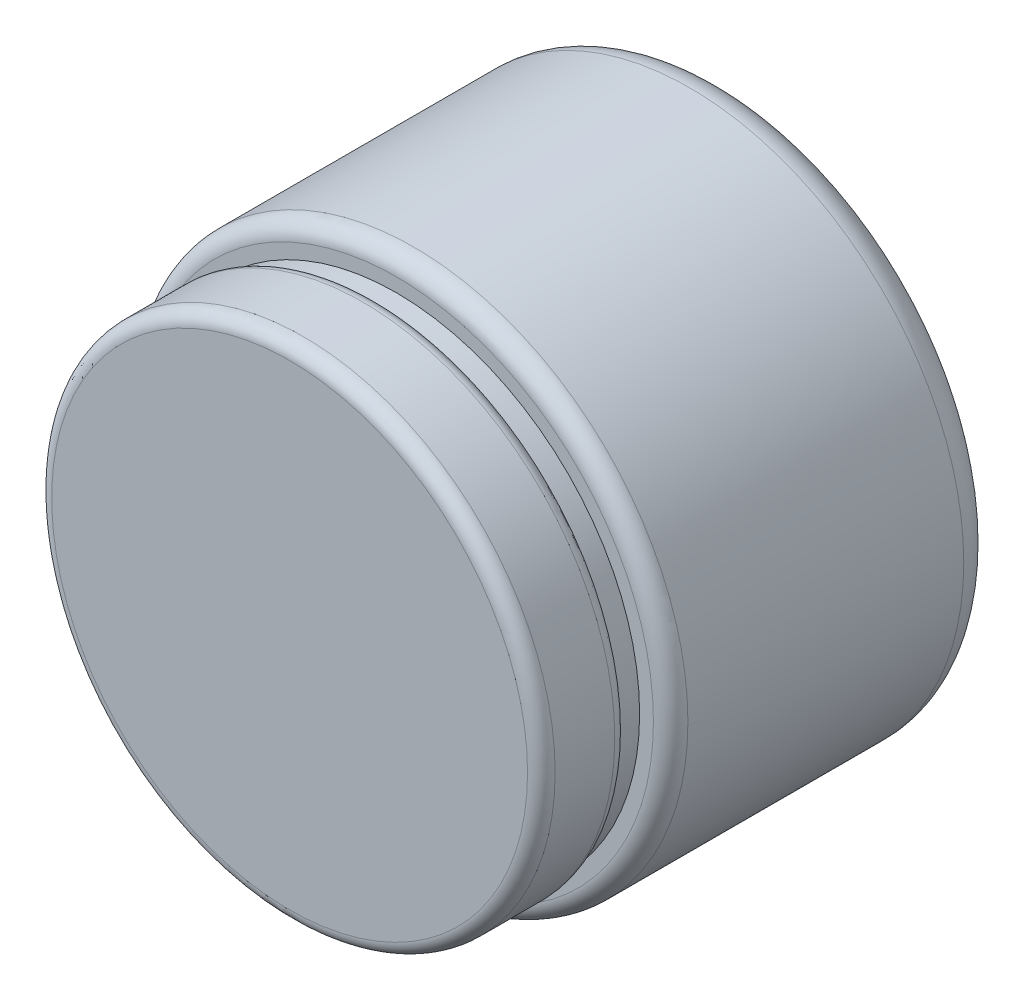
ISO-10303-21;
HEADER;
FILE_DESCRIPTION(('STEP AP214'),'2;1');
FILE_NAME('part.step','',(''),(''),'','','');
FILE_SCHEMA(('AUTOMOTIVE_DESIGN { 1 0 10303 214 1 1 1 1 }'));
ENDSEC;
DATA;
#1=APPLICATION_CONTEXT('core data for automotive mechanical design processes');
#2=APPLICATION_PROTOCOL_DEFINITION('international standard','automotive_design',2000,#1);
#3=PRODUCT_CONTEXT('',#1,'mechanical');
#4=PRODUCT('Part','Part','',(#3));
#5=PRODUCT_RELATED_PRODUCT_CATEGORY('part','',(#4));
#6=PRODUCT_DEFINITION_FORMATION('','',#4);
#7=PRODUCT_DEFINITION_CONTEXT('part definition',#1,'design');
#8=PRODUCT_DEFINITION('design','',#6,#7);
#9=PRODUCT_DEFINITION_SHAPE('','',#8);
#10=(LENGTH_UNIT() NAMED_UNIT(*) SI_UNIT(.MILLI.,.METRE.));
#11=(NAMED_UNIT(*) PLANE_ANGLE_UNIT() SI_UNIT($,.RADIAN.));
#12=(NAMED_UNIT(*) SI_UNIT($,.STERADIAN.) SOLID_ANGLE_UNIT());
#13=UNCERTAINTY_MEASURE_WITH_UNIT(LENGTH_MEASURE(1.E-05),#10,'distance_accuracy_value','');
#14=(GEOMETRIC_REPRESENTATION_CONTEXT(3) GLOBAL_UNCERTAINTY_ASSIGNED_CONTEXT((#13)) GLOBAL_UNIT_ASSIGNED_CONTEXT((#10,
#11,#12)) REPRESENTATION_CONTEXT('',''));
#15=CARTESIAN_POINT('',(0.,0.,0.));
#16=DIRECTION('',(0.,0.,1.));
#17=DIRECTION('',(1.,0.,0.));
#18=AXIS2_PLACEMENT_3D('',#15,#16,#17);
#19=CARTESIAN_POINT('',(0.,0.,12.7));
#20=DIRECTION('',(0.,0.,-1.));
#21=DIRECTION('',(-1.,0.,0.));
#22=AXIS2_PLACEMENT_3D('',#19,#20,#21);
#23=CYLINDRICAL_SURFACE('',#22,37.084);
#24=CARTESIAN_POINT('',(0.,0.,1.8837144157223));
#25=DIRECTION('',(0.,0.,-1.));
#26=DIRECTION('',(-1.,0.,0.));
#27=AXIS2_PLACEMENT_3D('',#24,#25,#26);
#28=CIRCLE('',#27,37.084);
#29=CARTESIAN_POINT('',(-37.084,0.,1.8837144157223));
#30=VERTEX_POINT('',#29);
#31=EDGE_CURVE('E40',#30,#30,#28,.F.);
#32=ORIENTED_EDGE('',*,*,#31,.T.);
#33=EDGE_LOOP('',(#32));
#34=FACE_BOUND('',#33,.T.);
#35=CARTESIAN_POINT('',(0.,0.,10.668));
#36=DIRECTION('',(0.,0.,1.));
#37=DIRECTION('',(1.,0.,0.));
#38=AXIS2_PLACEMENT_3D('',#35,#36,#37);
#39=CIRCLE('',#38,37.084);
#40=CARTESIAN_POINT('',(37.084,0.,10.668));
#41=VERTEX_POINT('',#40);
#42=EDGE_CURVE('E44',#41,#41,#39,.F.);
#43=ORIENTED_EDGE('',*,*,#42,.T.);
#44=EDGE_LOOP('',(#43));
#45=FACE_BOUND('',#44,.T.);
#46=ADVANCED_FACE('F33',(#34,#45),#23,.T.);
#47=CARTESIAN_POINT('',(0.,0.,12.7));
#48=DIRECTION('',(0.,0.,1.));
#49=DIRECTION('',(1.,0.,0.));
#50=AXIS2_PLACEMENT_3D('',#47,#48,#49);
#51=PLANE('',#50);
#52=CARTESIAN_POINT('',(0.,0.,12.7));
#53=DIRECTION('',(0.,0.,1.));
#54=DIRECTION('',(1.,0.,0.));
#55=AXIS2_PLACEMENT_3D('',#52,#53,#54);
#56=CIRCLE('',#55,35.052);
#57=CARTESIAN_POINT('',(35.052,0.,12.7));
#58=VERTEX_POINT('',#57);
#59=EDGE_CURVE('E10',#58,#58,#56,.T.);
#60=ORIENTED_EDGE('',*,*,#59,.T.);
#61=EDGE_LOOP('',(#60));
#62=FACE_BOUND('',#61,.T.);
#63=ADVANCED_FACE('F75',(#62),#51,.T.);
#64=CARTESIAN_POINT('',(0.,0.,-3.048));
#65=DIRECTION('',(0.,0.,1.));
#66=DIRECTION('',(1.,0.,0.));
#67=AXIS2_PLACEMENT_3D('',#64,#65,#66);
#68=CYLINDRICAL_SURFACE('',#67,35.814);
#69=CARTESIAN_POINT('',(0.,0.,-3.048));
#70=DIRECTION('',(0.,0.,-1.));
#71=DIRECTION('',(-1.,0.,0.));
#72=AXIS2_PLACEMENT_3D('',#69,#70,#71);
#73=CIRCLE('',#72,35.814);
#74=CARTESIAN_POINT('',(35.814,0.,-3.048));
#75=VERTEX_POINT('',#74);
#76=EDGE_CURVE('E65',#75,#75,#73,.T.);
#77=CARTESIAN_POINT('',(0.,0.,0.));
#78=DIRECTION('',(0.,0.,1.));
#79=DIRECTION('',(1.,0.,0.));
#80=AXIS2_PLACEMENT_3D('',#77,#78,#79);
#81=CIRCLE('',#80,35.814);
#82=CARTESIAN_POINT('',(35.814,0.,0.));
#83=VERTEX_POINT('',#82);
#84=EDGE_CURVE('E62',#83,#83,#81,.F.);
#85=CARTESIAN_POINT('',(35.814,0.,-3.048));
#86=CARTESIAN_POINT('',(35.814,0.,-3.01625));
#87=CARTESIAN_POINT('',(35.814,0.,-2.9845));
#88=CARTESIAN_POINT('',(35.814,0.,-2.921));
#89=CARTESIAN_POINT('',(35.814,0.,-2.88925));
#90=CARTESIAN_POINT('',(35.814,0.,-2.82575));
#91=CARTESIAN_POINT('',(35.814,0.,-2.794));
#92=CARTESIAN_POINT('',(35.814,0.,-2.7305));
#93=CARTESIAN_POINT('',(35.814,0.,-2.69875));
#94=CARTESIAN_POINT('',(35.814,0.,-2.63525));
#95=CARTESIAN_POINT('',(35.814,0.,-2.6035));
#96=CARTESIAN_POINT('',(35.814,0.,-2.54));
#97=CARTESIAN_POINT('',(35.814,0.,-2.50825));
#98=CARTESIAN_POINT('',(35.814,0.,-2.44475));
#99=CARTESIAN_POINT('',(35.814,0.,-2.413));
#100=CARTESIAN_POINT('',(35.814,0.,-2.3495));
#101=CARTESIAN_POINT('',(35.814,0.,-2.31775));
#102=CARTESIAN_POINT('',(35.814,0.,-2.25425));
#103=CARTESIAN_POINT('',(35.814,0.,-2.2225));
#104=CARTESIAN_POINT('',(35.814,0.,-2.159));
#105=CARTESIAN_POINT('',(35.814,0.,-2.12725));
#106=CARTESIAN_POINT('',(35.814,0.,-2.06375));
#107=CARTESIAN_POINT('',(35.814,0.,-2.032));
#108=CARTESIAN_POINT('',(35.814,0.,-1.9685));
#109=CARTESIAN_POINT('',(35.814,0.,-1.93675));
#110=CARTESIAN_POINT('',(35.814,0.,-1.87325));
#111=CARTESIAN_POINT('',(35.814,0.,-1.8415));
#112=CARTESIAN_POINT('',(35.814,0.,-1.778));
#113=CARTESIAN_POINT('',(35.814,0.,-1.74625));
#114=CARTESIAN_POINT('',(35.814,0.,-1.68275));
#115=CARTESIAN_POINT('',(35.814,0.,-1.651));
#116=CARTESIAN_POINT('',(35.814,0.,-1.5875));
#117=CARTESIAN_POINT('',(35.814,0.,-1.55575));
#118=CARTESIAN_POINT('',(35.814,0.,-1.49225));
#119=CARTESIAN_POINT('',(35.814,0.,-1.4605));
#120=CARTESIAN_POINT('',(35.814,0.,-1.397));
#121=CARTESIAN_POINT('',(35.814,0.,-1.36525));
#122=CARTESIAN_POINT('',(35.814,0.,-1.30175));
#123=CARTESIAN_POINT('',(35.814,0.,-1.27));
#124=CARTESIAN_POINT('',(35.814,0.,-1.2065));
#125=CARTESIAN_POINT('',(35.814,0.,-1.17475));
#126=CARTESIAN_POINT('',(35.814,0.,-1.11125));
#127=CARTESIAN_POINT('',(35.814,0.,-1.0795));
#128=CARTESIAN_POINT('',(35.814,0.,-1.016));
#129=CARTESIAN_POINT('',(35.814,0.,-0.98425));
#130=CARTESIAN_POINT('',(35.814,0.,-0.92075));
#131=CARTESIAN_POINT('',(35.814,0.,-0.889));
#132=CARTESIAN_POINT('',(35.814,0.,-0.8255));
#133=CARTESIAN_POINT('',(35.814,0.,-0.79375));
#134=CARTESIAN_POINT('',(35.814,0.,-0.73025));
#135=CARTESIAN_POINT('',(35.814,0.,-0.6985));
#136=CARTESIAN_POINT('',(35.814,0.,-0.635));
#137=CARTESIAN_POINT('',(35.814,0.,-0.60325));
#138=CARTESIAN_POINT('',(35.814,0.,-0.53975));
#139=CARTESIAN_POINT('',(35.814,0.,-0.508));
#140=CARTESIAN_POINT('',(35.814,0.,-0.4445));
#141=CARTESIAN_POINT('',(35.814,0.,-0.41275));
#142=CARTESIAN_POINT('',(35.814,0.,-0.34925));
#143=CARTESIAN_POINT('',(35.814,0.,-0.3175));
#144=CARTESIAN_POINT('',(35.814,0.,-0.254));
#145=CARTESIAN_POINT('',(35.814,0.,-0.22225));
#146=CARTESIAN_POINT('',(35.814,0.,-0.15875));
#147=CARTESIAN_POINT('',(35.814,0.,-0.127));
#148=CARTESIAN_POINT('',(35.814,0.,-0.0634999999999999));
#149=CARTESIAN_POINT('',(35.814,0.,-0.03175));
#150=CARTESIAN_POINT('',(35.814,0.,0.));
#151=B_SPLINE_CURVE_WITH_KNOTS('',3,(#85,#86,#87,#88,#89,#90,#91,#92,#93,#94,#95,#96,#97,#98,
#99,#100,#101,#102,#103,#104,#105,#106,#107,#108,#109,#110,#111,#112,#113,#114,#115,#116,#117,
#118,#119,#120,#121,#122,#123,#124,#125,#126,#127,#128,#129,#130,#131,#132,#133,#134,#135,#136,
#137,#138,#139,#140,#141,#142,#143,#144,#145,#146,#147,#148,#149,#150),.UNSPECIFIED.,.F.,.F.,(4,
2,2,2,2,2,2,2,2,2,2,2,2,2,2,2,2,2,2,2,2,2,2,2,2,2,2,2,2,2,2,2,4),(0.,0.0952499999999998,0.1905,
0.28575,0.381,0.47625,0.5715,0.66675,0.762,0.85725,0.9525,1.04775,1.143,1.23825,1.3335,1.42875,
1.524,1.61925,1.7145,1.80975,1.905,2.00025,2.0955,2.19075,2.286,2.38125,2.4765,2.57175,2.667,
2.76225,2.8575,2.95275,3.048),.UNSPECIFIED.);
#152=EDGE_CURVE('BSEAM71',#75,#83,#151,.T.);
#153=ORIENTED_EDGE('',*,*,#76,.F.);
#154=ORIENTED_EDGE('',*,*,#84,.T.);
#155=ORIENTED_EDGE('',*,*,#152,.T.);
#156=ORIENTED_EDGE('',*,*,#152,.F.);
#157=EDGE_LOOP('',(#153,#155,#154,#156));
#158=FACE_BOUND('',#157,.T.);
#159=ADVANCED_FACE('F71',(#158),#68,.T.);
#160=CARTESIAN_POINT('',(0.,0.,-51.308));
#161=DIRECTION('',(0.,0.,1.));
#162=DIRECTION('',(1.,0.,0.));
#163=AXIS2_PLACEMENT_3D('',#160,#161,#162);
#164=CYLINDRICAL_SURFACE('',#163,40.386);
#165=CARTESIAN_POINT('',(0.,0.,-46.228));
#166=DIRECTION('',(0.,0.,-1.));
#167=DIRECTION('',(-1.,0.,0.));
#168=AXIS2_PLACEMENT_3D('',#165,#166,#167);
#169=CIRCLE('',#168,40.386);
#170=CARTESIAN_POINT('',(40.386,0.,-46.228));
#171=VERTEX_POINT('',#170);
#172=EDGE_CURVE('E48',#171,#171,#169,.F.);
#173=CARTESIAN_POINT('',(0.,0.,-5.588));
#174=DIRECTION('',(0.,0.,-1.));
#175=DIRECTION('',(-1.,0.,0.));
#176=AXIS2_PLACEMENT_3D('',#173,#174,#175);
#177=CIRCLE('',#176,40.386);
#178=CARTESIAN_POINT('',(40.386,0.,-5.588));
#179=VERTEX_POINT('',#178);
#180=EDGE_CURVE('E59',#179,#179,#177,.T.);
#181=CARTESIAN_POINT('',(40.386,0.,-46.228));
#182=CARTESIAN_POINT('',(40.386,0.,-45.8046666666667));
#183=CARTESIAN_POINT('',(40.386,0.,-45.3813333333333));
#184=CARTESIAN_POINT('',(40.386,0.,-44.5346666666667));
#185=CARTESIAN_POINT('',(40.386,0.,-44.1113333333333));
#186=CARTESIAN_POINT('',(40.386,0.,-43.2646666666667));
#187=CARTESIAN_POINT('',(40.386,0.,-42.8413333333333));
#188=CARTESIAN_POINT('',(40.386,0.,-41.9946666666667));
#189=CARTESIAN_POINT('',(40.386,0.,-41.5713333333333));
#190=CARTESIAN_POINT('',(40.386,0.,-40.7246666666667));
#191=CARTESIAN_POINT('',(40.386,0.,-40.3013333333333));
#192=CARTESIAN_POINT('',(40.386,0.,-39.4546666666667));
#193=CARTESIAN_POINT('',(40.386,0.,-39.0313333333333));
#194=CARTESIAN_POINT('',(40.386,0.,-38.1846666666667));
#195=CARTESIAN_POINT('',(40.386,0.,-37.7613333333333));
#196=CARTESIAN_POINT('',(40.386,0.,-36.9146666666667));
#197=CARTESIAN_POINT('',(40.386,0.,-36.4913333333333));
#198=CARTESIAN_POINT('',(40.386,0.,-35.6446666666667));
#199=CARTESIAN_POINT('',(40.386,0.,-35.2213333333333));
#200=CARTESIAN_POINT('',(40.386,0.,-34.3746666666667));
#201=CARTESIAN_POINT('',(40.386,0.,-33.9513333333333));
#202=CARTESIAN_POINT('',(40.386,0.,-33.1046666666667));
#203=CARTESIAN_POINT('',(40.386,0.,-32.6813333333333));
#204=CARTESIAN_POINT('',(40.386,0.,-31.8346666666667));
#205=CARTESIAN_POINT('',(40.386,0.,-31.4113333333333));
#206=CARTESIAN_POINT('',(40.386,0.,-30.5646666666667));
#207=CARTESIAN_POINT('',(40.386,0.,-30.1413333333333));
#208=CARTESIAN_POINT('',(40.386,0.,-29.2946666666667));
#209=CARTESIAN_POINT('',(40.386,0.,-28.8713333333333));
#210=CARTESIAN_POINT('',(40.386,0.,-28.0246666666667));
#211=CARTESIAN_POINT('',(40.386,0.,-27.6013333333333));
#212=CARTESIAN_POINT('',(40.386,0.,-26.7546666666667));
#213=CARTESIAN_POINT('',(40.386,0.,-26.3313333333333));
#214=CARTESIAN_POINT('',(40.386,0.,-25.4846666666667));
#215=CARTESIAN_POINT('',(40.386,0.,-25.0613333333333));
#216=CARTESIAN_POINT('',(40.386,0.,-24.2146666666667));
#217=CARTESIAN_POINT('',(40.386,0.,-23.7913333333333));
#218=CARTESIAN_POINT('',(40.386,0.,-22.9446666666667));
#219=CARTESIAN_POINT('',(40.386,0.,-22.5213333333333));
#220=CARTESIAN_POINT('',(40.386,0.,-21.6746666666667));
#221=CARTESIAN_POINT('',(40.386,0.,-21.2513333333333));
#222=CARTESIAN_POINT('',(40.386,0.,-20.4046666666667));
#223=CARTESIAN_POINT('',(40.386,0.,-19.9813333333333));
#224=CARTESIAN_POINT('',(40.386,0.,-19.1346666666667));
#225=CARTESIAN_POINT('',(40.386,0.,-18.7113333333333));
#226=CARTESIAN_POINT('',(40.386,0.,-17.8646666666667));
#227=CARTESIAN_POINT('',(40.386,0.,-17.4413333333333));
#228=CARTESIAN_POINT('',(40.386,0.,-16.5946666666667));
#229=CARTESIAN_POINT('',(40.386,0.,-16.1713333333333));
#230=CARTESIAN_POINT('',(40.386,0.,-15.3246666666667));
#231=CARTESIAN_POINT('',(40.386,0.,-14.9013333333333));
#232=CARTESIAN_POINT('',(40.386,0.,-14.0546666666667));
#233=CARTESIAN_POINT('',(40.386,0.,-13.6313333333333));
#234=CARTESIAN_POINT('',(40.386,0.,-12.7846666666667));
#235=CARTESIAN_POINT('',(40.386,0.,-12.3613333333333));
#236=CARTESIAN_POINT('',(40.386,0.,-11.5146666666667));
#237=CARTESIAN_POINT('',(40.386,0.,-11.0913333333333));
#238=CARTESIAN_POINT('',(40.386,0.,-10.2446666666667));
#239=CARTESIAN_POINT('',(40.386,0.,-9.82133333333333));
#240=CARTESIAN_POINT('',(40.386,0.,-8.97466666666666));
#241=CARTESIAN_POINT('',(40.386,0.,-8.55133333333333));
#242=CARTESIAN_POINT('',(40.386,0.,-7.70466666666666));
#243=CARTESIAN_POINT('',(40.386,0.,-7.28133333333332));
#244=CARTESIAN_POINT('',(40.386,0.,-6.43466666666666));
#245=CARTESIAN_POINT('',(40.386,0.,-6.01133333333333));
#246=CARTESIAN_POINT('',(40.386,0.,-5.588));
#247=B_SPLINE_CURVE_WITH_KNOTS('',3,(#181,#182,#183,#184,#185,#186,#187,#188,#189,#190,#191,
#192,#193,#194,#195,#196,#197,#198,#199,#200,#201,#202,#203,#204,#205,#206,#207,#208,#209,#210,
#211,#212,#213,#214,#215,#216,#217,#218,#219,#220,#221,#222,#223,#224,#225,#226,#227,#228,#229,
#230,#231,#232,#233,#234,#235,#236,#237,#238,#239,#240,#241,#242,#243,#244,#245,#246),
.UNSPECIFIED.,.F.,.F.,(4,2,2,2,2,2,2,2,2,2,2,2,2,2,2,2,2,2,2,2,2,2,2,2,2,2,2,2,2,2,2,2,4),(0.,
1.27,2.54,3.81,5.08,6.35,7.62,8.89,10.16,11.43,12.7,13.97,15.24,16.51,17.78,19.05,20.32,21.59,
22.86,24.13,25.4,26.67,27.94,29.21,30.48,31.75,33.02,34.29,35.56,36.83,38.1,39.37,40.64),.UNSPECIFIED.);
#248=EDGE_CURVE('BSEAM74',#171,#179,#247,.T.);
#249=ORIENTED_EDGE('',*,*,#172,.T.);
#250=ORIENTED_EDGE('',*,*,#180,.T.);
#251=ORIENTED_EDGE('',*,*,#248,.T.);
#252=ORIENTED_EDGE('',*,*,#248,.F.);
#253=EDGE_LOOP('',(#249,#251,#250,#252));
#254=FACE_BOUND('',#253,.T.);
#255=ADVANCED_FACE('F74',(#254),#164,.T.);
#256=CARTESIAN_POINT('',(0.,0.,-51.308));
#257=DIRECTION('',(0.,0.,-1.));
#258=DIRECTION('',(-1.,0.,0.));
#259=AXIS2_PLACEMENT_3D('',#256,#257,#258);
#260=PLANE('',#259);
#261=CARTESIAN_POINT('',(0.,0.,-51.308));
#262=DIRECTION('',(0.,0.,-1.));
#263=DIRECTION('',(-1.,0.,0.));
#264=AXIS2_PLACEMENT_3D('',#261,#262,#263);
#265=CIRCLE('',#264,35.306);
#266=CARTESIAN_POINT('',(-35.306,0.,-51.308));
#267=VERTEX_POINT('',#266);
#268=EDGE_CURVE('E53',#267,#267,#265,.T.);
#269=ORIENTED_EDGE('',*,*,#268,.T.);
#270=EDGE_LOOP('',(#269));
#271=FACE_BOUND('',#270,.T.);
#272=ADVANCED_FACE('F105',(#271),#260,.T.);
#273=CARTESIAN_POINT('',(0.,0.,-3.048));
#274=DIRECTION('',(0.,0.,-1.));
#275=DIRECTION('',(-1.,0.,0.));
#276=AXIS2_PLACEMENT_3D('',#273,#274,#275);
#277=PLANE('',#276);
#278=CARTESIAN_POINT('',(0.,0.,-3.048));
#279=DIRECTION('',(0.,0.,-1.));
#280=DIRECTION('',(-1.,0.,0.));
#281=AXIS2_PLACEMENT_3D('',#278,#279,#280);
#282=CIRCLE('',#281,37.846);
#283=CARTESIAN_POINT('',(-37.846,0.,-3.048));
#284=VERTEX_POINT('',#283);
#285=EDGE_CURVE('E56',#284,#284,#282,.F.);
#286=ORIENTED_EDGE('',*,*,#285,.T.);
#287=EDGE_LOOP('',(#286));
#288=FACE_BOUND('',#287,.T.);
#289=ORIENTED_EDGE('',*,*,#76,.T.);
#290=EDGE_LOOP('',(#289));
#291=FACE_BOUND('',#290,.T.);
#292=ADVANCED_FACE('F69',(#288,#291),#277,.F.);
#293=CARTESIAN_POINT('',(0.,0.,-5.588));
#294=DIRECTION('',(0.,0.,-1.));
#295=DIRECTION('',(-1.,0.,0.));
#296=AXIS2_PLACEMENT_3D('',#293,#294,#295);
#297=TOROIDAL_SURFACE('',#296,37.846,2.54);
#298=ORIENTED_EDGE('',*,*,#285,.F.);
#299=EDGE_LOOP('',(#298));
#300=FACE_BOUND('',#299,.T.);
#301=ORIENTED_EDGE('',*,*,#180,.F.);
#302=EDGE_LOOP('',(#301));
#303=FACE_BOUND('',#302,.T.);
#304=ADVANCED_FACE('F88',(#300,#303),#297,.T.);
#305=CARTESIAN_POINT('',(0.,0.,-46.228));
#306=DIRECTION('',(0.,0.,-1.));
#307=DIRECTION('',(-1.,0.,0.));
#308=AXIS2_PLACEMENT_3D('',#305,#306,#307);
#309=TOROIDAL_SURFACE('',#308,35.306,5.08);
#310=ORIENTED_EDGE('',*,*,#172,.F.);
#311=EDGE_LOOP('',(#310));
#312=FACE_BOUND('',#311,.T.);
#313=ORIENTED_EDGE('',*,*,#268,.F.);
#314=EDGE_LOOP('',(#313));
#315=FACE_BOUND('',#314,.T.);
#316=ADVANCED_FACE('F82',(#312,#315),#309,.T.);
#317=CARTESIAN_POINT('',(0.,0.,1.8837144157223));
#318=DIRECTION('',(0.,0.,-1.));
#319=DIRECTION('',(-1.,0.,0.));
#320=AXIS2_PLACEMENT_3D('',#317,#318,#319);
#321=TOROIDAL_SURFACE('',#320,35.052,2.032);
#322=ORIENTED_EDGE('',*,*,#84,.F.);
#323=EDGE_LOOP('',(#322));
#324=FACE_BOUND('',#323,.T.);
#325=ORIENTED_EDGE('',*,*,#31,.F.);
#326=EDGE_LOOP('',(#325));
#327=FACE_BOUND('',#326,.T.);
#328=ADVANCED_FACE('F79',(#324,#327),#321,.T.);
#329=CARTESIAN_POINT('',(0.,0.,10.668));
#330=DIRECTION('',(0.,0.,1.));
#331=DIRECTION('',(1.,0.,0.));
#332=AXIS2_PLACEMENT_3D('',#329,#330,#331);
#333=TOROIDAL_SURFACE('',#332,35.052,2.032);
#334=ORIENTED_EDGE('',*,*,#42,.F.);
#335=EDGE_LOOP('',(#334));
#336=FACE_BOUND('',#335,.T.);
#337=ORIENTED_EDGE('',*,*,#59,.F.);
#338=EDGE_LOOP('',(#337));
#339=FACE_BOUND('',#338,.T.);
#340=ADVANCED_FACE('F35',(#336,#339),#333,.T.);
#341=CLOSED_SHELL('',(#46,#63,#159,#255,#272,#292,#304,#316,#328,#340));
#342=MANIFOLD_SOLID_BREP('B2',#341);
#343=ADVANCED_BREP_SHAPE_REPRESENTATION('',(#18,#342),#14);
#344=SHAPE_DEFINITION_REPRESENTATION(#9,#343);
ENDSEC;
END-ISO-10303-21;
